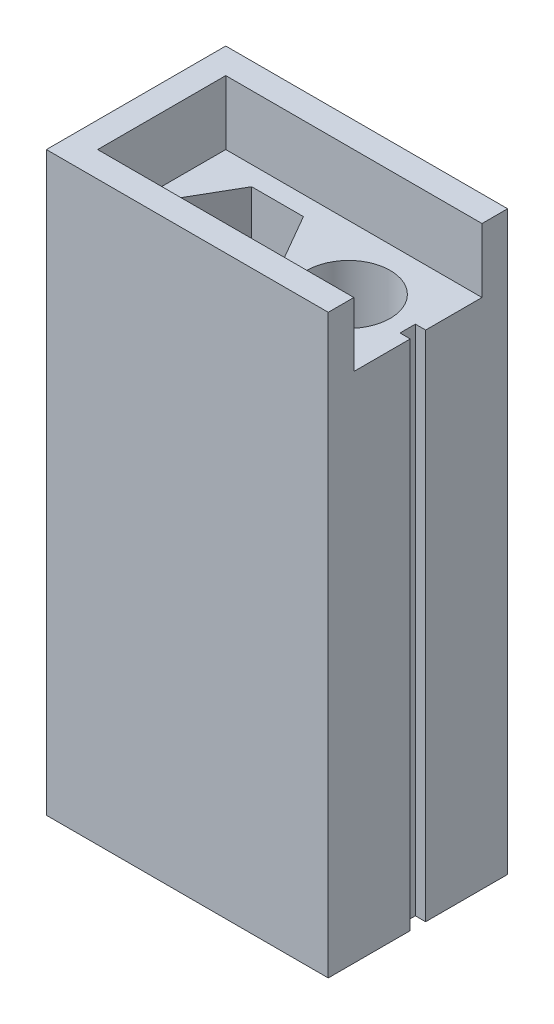
ISO-10303-21;
HEADER;
FILE_DESCRIPTION(('STEP AP214'),'2;1');
FILE_NAME('part.step','',(''),(''),'','','');
FILE_SCHEMA(('AUTOMOTIVE_DESIGN { 1 0 10303 214 1 1 1 1 }'));
ENDSEC;
DATA;
#1=APPLICATION_CONTEXT('core data for automotive mechanical design processes');
#2=APPLICATION_PROTOCOL_DEFINITION('international standard','automotive_design',2000,#1);
#3=PRODUCT_CONTEXT('',#1,'mechanical');
#4=PRODUCT('Part','Part','',(#3));
#5=PRODUCT_RELATED_PRODUCT_CATEGORY('part','',(#4));
#6=PRODUCT_DEFINITION_FORMATION('','',#4);
#7=PRODUCT_DEFINITION_CONTEXT('part definition',#1,'design');
#8=PRODUCT_DEFINITION('design','',#6,#7);
#9=PRODUCT_DEFINITION_SHAPE('','',#8);
#10=(LENGTH_UNIT() NAMED_UNIT(*) SI_UNIT(.MILLI.,.METRE.));
#11=(NAMED_UNIT(*) PLANE_ANGLE_UNIT() SI_UNIT($,.RADIAN.));
#12=(NAMED_UNIT(*) SI_UNIT($,.STERADIAN.) SOLID_ANGLE_UNIT());
#13=UNCERTAINTY_MEASURE_WITH_UNIT(LENGTH_MEASURE(1.E-05),#10,'distance_accuracy_value','');
#14=(GEOMETRIC_REPRESENTATION_CONTEXT(3) GLOBAL_UNCERTAINTY_ASSIGNED_CONTEXT((#13)) GLOBAL_UNIT_ASSIGNED_CONTEXT((#10,
#11,#12)) REPRESENTATION_CONTEXT('',''));
#15=CARTESIAN_POINT('',(0.,0.,0.));
#16=DIRECTION('',(0.,0.,1.));
#17=DIRECTION('',(1.,0.,0.));
#18=AXIS2_PLACEMENT_3D('',#15,#16,#17);
#19=CARTESIAN_POINT('',(22.,40.,0.));
#20=DIRECTION('',(-1.,0.,0.));
#21=DIRECTION('',(0.,0.,1.));
#22=AXIS2_PLACEMENT_3D('',#19,#20,#21);
#23=PLANE('',#22);
#24=DIRECTION('',(0.,0.,-1.));
#25=VECTOR('',#24,1.);
#26=CARTESIAN_POINT('',(22.,0.,0.));
#27=LINE('',#26,#25);
#28=CARTESIAN_POINT('',(22.,0.,0.));
#29=VERTEX_POINT('',#28);
#30=CARTESIAN_POINT('',(22.,0.,-6.40000000000001));
#31=VERTEX_POINT('',#30);
#32=EDGE_CURVE('E324',#29,#31,#27,.T.);
#33=ORIENTED_EDGE('',*,*,#32,.T.);
#34=DIRECTION('',(0.,-1.,0.));
#35=VECTOR('',#34,1.);
#36=CARTESIAN_POINT('',(22.,40.,-6.4));
#37=LINE('',#36,#35);
#38=CARTESIAN_POINT('',(22.,40.,-6.4));
#39=VERTEX_POINT('',#38);
#40=EDGE_CURVE('E321',#39,#31,#37,.T.);
#41=ORIENTED_EDGE('',*,*,#40,.F.);
#42=DIRECTION('',(0.,0.,-1.));
#43=VECTOR('',#42,1.);
#44=CARTESIAN_POINT('',(22.,40.,0.));
#45=LINE('',#44,#43);
#46=CARTESIAN_POINT('',(22.,40.,-2.));
#47=VERTEX_POINT('',#46);
#48=EDGE_CURVE('E300',#47,#39,#45,.T.);
#49=ORIENTED_EDGE('',*,*,#48,.F.);
#50=DIRECTION('',(0.,-1.,0.));
#51=VECTOR('',#50,1.);
#52=CARTESIAN_POINT('',(22.,45.,-2.));
#53=LINE('',#52,#51);
#54=CARTESIAN_POINT('',(22.,45.,-2.));
#55=VERTEX_POINT('',#54);
#56=EDGE_CURVE('E289',#55,#47,#53,.T.);
#57=ORIENTED_EDGE('',*,*,#56,.F.);
#58=DIRECTION('',(0.,0.,-1.));
#59=VECTOR('',#58,1.);
#60=CARTESIAN_POINT('',(22.,45.,0.));
#61=LINE('',#60,#59);
#62=CARTESIAN_POINT('',(22.,45.,0.));
#63=VERTEX_POINT('',#62);
#64=EDGE_CURVE('E245',#63,#55,#61,.T.);
#65=ORIENTED_EDGE('',*,*,#64,.F.);
#66=DIRECTION('',(0.,-1.,0.));
#67=VECTOR('',#66,1.);
#68=CARTESIAN_POINT('',(22.,40.,0.));
#69=LINE('',#68,#67);
#70=EDGE_CURVE('E43',#63,#29,#69,.T.);
#71=ORIENTED_EDGE('',*,*,#70,.T.);
#72=EDGE_LOOP('',(#33,#41,#49,#57,#65,#71));
#73=FACE_BOUND('',#72,.T.);
#74=ADVANCED_FACE('F33',(#73),#23,.F.);
#75=CARTESIAN_POINT('',(0.,40.,0.));
#76=DIRECTION('',(0.,-1.,0.));
#77=DIRECTION('',(0.,0.,-1.));
#78=AXIS2_PLACEMENT_3D('',#75,#76,#77);
#79=PLANE('',#78);
#80=ORIENTED_EDGE('',*,*,#48,.T.);
#81=DIRECTION('',(1.,0.,0.));
#82=VECTOR('',#81,1.);
#83=CARTESIAN_POINT('',(21.2,40.,-6.4));
#84=LINE('',#83,#82);
#85=CARTESIAN_POINT('',(21.2,40.,-6.4));
#86=VERTEX_POINT('',#85);
#87=EDGE_CURVE('E184',#86,#39,#84,.T.);
#88=ORIENTED_EDGE('',*,*,#87,.F.);
#89=DIRECTION('',(0.,0.,1.));
#90=VECTOR('',#89,1.);
#91=CARTESIAN_POINT('',(21.2,40.,-6.4));
#92=LINE('',#91,#90);
#93=CARTESIAN_POINT('',(21.2,40.,-7.6));
#94=VERTEX_POINT('',#93);
#95=EDGE_CURVE('E169',#94,#86,#92,.T.);
#96=ORIENTED_EDGE('',*,*,#95,.F.);
#97=DIRECTION('',(1.,0.,0.));
#98=VECTOR('',#97,1.);
#99=CARTESIAN_POINT('',(21.2,40.,-7.6));
#100=LINE('',#99,#98);
#101=CARTESIAN_POINT('',(22.,40.,-7.6));
#102=VERTEX_POINT('',#101);
#103=EDGE_CURVE('E167',#94,#102,#100,.T.);
#104=ORIENTED_EDGE('',*,*,#103,.T.);
#105=CARTESIAN_POINT('',(22.,40.,-12.));
#106=VERTEX_POINT('',#105);
#107=EDGE_CURVE('E37',#102,#106,#45,.T.);
#108=ORIENTED_EDGE('',*,*,#107,.T.);
#109=DIRECTION('',(1.,0.,0.));
#110=VECTOR('',#109,1.);
#111=CARTESIAN_POINT('',(2.,40.,-12.));
#112=LINE('',#111,#110);
#113=CARTESIAN_POINT('',(2.,40.,-12.));
#114=VERTEX_POINT('',#113);
#115=EDGE_CURVE('E246',#114,#106,#112,.T.);
#116=ORIENTED_EDGE('',*,*,#115,.F.);
#117=DIRECTION('',(0.,0.,-1.));
#118=VECTOR('',#117,1.);
#119=CARTESIAN_POINT('',(2.,40.,-2.));
#120=LINE('',#119,#118);
#121=CARTESIAN_POINT('',(2.,40.,-2.));
#122=VERTEX_POINT('',#121);
#123=EDGE_CURVE('E264',#122,#114,#120,.T.);
#124=ORIENTED_EDGE('',*,*,#123,.F.);
#125=DIRECTION('',(-1.,0.,0.));
#126=VECTOR('',#125,1.);
#127=CARTESIAN_POINT('',(22.,40.,-2.));
#128=LINE('',#127,#126);
#129=EDGE_CURVE('E239',#47,#122,#128,.T.);
#130=ORIENTED_EDGE('',*,*,#129,.F.);
#131=EDGE_LOOP('',(#80,#88,#96,#104,#108,#116,#124,#130));
#132=FACE_BOUND('',#131,.T.);
#133=DIRECTION('',(-0.5,0.,-0.866025403784438));
#134=VECTOR('',#133,1.);
#135=CARTESIAN_POINT('',(11.5829037686548,40.,-7.));
#136=LINE('',#135,#134);
#137=CARTESIAN_POINT('',(11.5829037686548,40.,-7.));
#138=VERTEX_POINT('',#137);
#139=CARTESIAN_POINT('',(9.56217782649108,40.,-10.5));
#140=VERTEX_POINT('',#139);
#141=EDGE_CURVE('E210',#138,#140,#136,.T.);
#142=ORIENTED_EDGE('',*,*,#141,.F.);
#143=DIRECTION('',(0.5,0.,-0.866025403784439));
#144=VECTOR('',#143,1.);
#145=CARTESIAN_POINT('',(9.56217782649108,40.,-3.5));
#146=LINE('',#145,#144);
#147=CARTESIAN_POINT('',(9.56217782649108,40.,-3.5));
#148=VERTEX_POINT('',#147);
#149=EDGE_CURVE('E59',#148,#138,#146,.T.);
#150=ORIENTED_EDGE('',*,*,#149,.F.);
#151=DIRECTION('',(1.,0.,0.));
#152=VECTOR('',#151,1.);
#153=CARTESIAN_POINT('',(5.52072594216369,40.,-3.5));
#154=LINE('',#153,#152);
#155=CARTESIAN_POINT('',(5.52072594216369,40.,-3.5));
#156=VERTEX_POINT('',#155);
#157=EDGE_CURVE('E193',#156,#148,#154,.T.);
#158=ORIENTED_EDGE('',*,*,#157,.F.);
#159=DIRECTION('',(0.5,0.,0.866025403784438));
#160=VECTOR('',#159,1.);
#161=CARTESIAN_POINT('',(3.5,40.,-7.));
#162=LINE('',#161,#160);
#163=CARTESIAN_POINT('',(3.5,40.,-7.));
#164=VERTEX_POINT('',#163);
#165=EDGE_CURVE('E219',#164,#156,#162,.T.);
#166=ORIENTED_EDGE('',*,*,#165,.F.);
#167=DIRECTION('',(-0.5,0.,0.866025403784439));
#168=VECTOR('',#167,1.);
#169=CARTESIAN_POINT('',(5.52072594216369,40.,-10.5));
#170=LINE('',#169,#168);
#171=CARTESIAN_POINT('',(5.52072594216369,40.,-10.5));
#172=VERTEX_POINT('',#171);
#173=EDGE_CURVE('E216',#172,#164,#170,.T.);
#174=ORIENTED_EDGE('',*,*,#173,.F.);
#175=DIRECTION('',(-1.,0.,0.));
#176=VECTOR('',#175,1.);
#177=CARTESIAN_POINT('',(9.56217782649108,40.,-10.5));
#178=LINE('',#177,#176);
#179=EDGE_CURVE('E213',#140,#172,#178,.T.);
#180=ORIENTED_EDGE('',*,*,#179,.F.);
#181=EDGE_LOOP('',(#142,#150,#158,#166,#174,#180));
#182=FACE_BOUND('',#181,.T.);
#183=CARTESIAN_POINT('',(16.5829037686548,40.,-7.));
#184=DIRECTION('',(0.,1.,0.));
#185=DIRECTION('',(0.,0.,1.));
#186=AXIS2_PLACEMENT_3D('',#183,#184,#185);
#187=CIRCLE('',#186,3.25);
#188=CARTESIAN_POINT('',(16.5829037686548,40.,-3.75));
#189=VERTEX_POINT('',#188);
#190=EDGE_CURVE('E226',#189,#189,#187,.T.);
#191=ORIENTED_EDGE('',*,*,#190,.F.);
#192=EDGE_LOOP('',(#191));
#193=FACE_BOUND('',#192,.T.);
#194=ADVANCED_FACE('F314',(#132,#182,#193),#79,.F.);
#195=CARTESIAN_POINT('',(0.,40.,0.));
#196=DIRECTION('',(1.,0.,0.));
#197=DIRECTION('',(0.,0.,-1.));
#198=AXIS2_PLACEMENT_3D('',#195,#196,#197);
#199=PLANE('',#198);
#200=DIRECTION('',(0.,0.,1.));
#201=VECTOR('',#200,1.);
#202=CARTESIAN_POINT('',(0.,0.,0.));
#203=LINE('',#202,#201);
#204=CARTESIAN_POINT('',(0.,0.,-14.));
#205=VERTEX_POINT('',#204);
#206=CARTESIAN_POINT('',(0.,0.,0.));
#207=VERTEX_POINT('',#206);
#208=EDGE_CURVE('E294',#205,#207,#203,.T.);
#209=ORIENTED_EDGE('',*,*,#208,.T.);
#210=DIRECTION('',(0.,-1.,0.));
#211=VECTOR('',#210,1.);
#212=CARTESIAN_POINT('',(0.,40.,0.));
#213=LINE('',#212,#211);
#214=CARTESIAN_POINT('',(0.,45.,0.));
#215=VERTEX_POINT('',#214);
#216=EDGE_CURVE('E11',#215,#207,#213,.T.);
#217=ORIENTED_EDGE('',*,*,#216,.F.);
#218=DIRECTION('',(0.,0.,1.));
#219=VECTOR('',#218,1.);
#220=CARTESIAN_POINT('',(0.,45.,-14.));
#221=LINE('',#220,#219);
#222=CARTESIAN_POINT('',(0.,45.,-14.));
#223=VERTEX_POINT('',#222);
#224=EDGE_CURVE('E260',#223,#215,#221,.T.);
#225=ORIENTED_EDGE('',*,*,#224,.F.);
#226=DIRECTION('',(0.,-1.,0.));
#227=VECTOR('',#226,1.);
#228=CARTESIAN_POINT('',(0.,40.,-14.));
#229=LINE('',#228,#227);
#230=EDGE_CURVE('E303',#223,#205,#229,.T.);
#231=ORIENTED_EDGE('',*,*,#230,.T.);
#232=EDGE_LOOP('',(#209,#217,#225,#231));
#233=FACE_BOUND('',#232,.T.);
#234=ADVANCED_FACE('F35',(#233),#199,.F.);
#235=CARTESIAN_POINT('',(0.,40.,0.));
#236=DIRECTION('',(0.,0.,-1.));
#237=DIRECTION('',(-1.,0.,0.));
#238=AXIS2_PLACEMENT_3D('',#235,#236,#237);
#239=PLANE('',#238);
#240=DIRECTION('',(1.,0.,0.));
#241=VECTOR('',#240,1.);
#242=CARTESIAN_POINT('',(0.,0.,0.));
#243=LINE('',#242,#241);
#244=EDGE_CURVE('E344',#207,#29,#243,.T.);
#245=ORIENTED_EDGE('',*,*,#244,.T.);
#246=ORIENTED_EDGE('',*,*,#70,.F.);
#247=DIRECTION('',(1.,0.,0.));
#248=VECTOR('',#247,1.);
#249=CARTESIAN_POINT('',(0.,45.,0.));
#250=LINE('',#249,#248);
#251=EDGE_CURVE('E242',#215,#63,#250,.T.);
#252=ORIENTED_EDGE('',*,*,#251,.F.);
#253=ORIENTED_EDGE('',*,*,#216,.T.);
#254=EDGE_LOOP('',(#245,#246,#252,#253));
#255=FACE_BOUND('',#254,.T.);
#256=ADVANCED_FACE('F346',(#255),#239,.F.);
#257=ORIENTED_EDGE('',*,*,#107,.F.);
#258=DIRECTION('',(0.,1.,0.));
#259=VECTOR('',#258,1.);
#260=CARTESIAN_POINT('',(22.,40.,-7.6));
#261=LINE('',#260,#259);
#262=CARTESIAN_POINT('',(22.,0.,-7.60000000000001));
#263=VERTEX_POINT('',#262);
#264=EDGE_CURVE('E326',#263,#102,#261,.T.);
#265=ORIENTED_EDGE('',*,*,#264,.F.);
#266=CARTESIAN_POINT('',(22.,0.,-14.));
#267=VERTEX_POINT('',#266);
#268=EDGE_CURVE('E181',#263,#267,#27,.T.);
#269=ORIENTED_EDGE('',*,*,#268,.T.);
#270=DIRECTION('',(0.,-1.,0.));
#271=VECTOR('',#270,1.);
#272=CARTESIAN_POINT('',(22.,40.,-14.));
#273=LINE('',#272,#271);
#274=CARTESIAN_POINT('',(22.,45.,-14.));
#275=VERTEX_POINT('',#274);
#276=EDGE_CURVE('E340',#275,#267,#273,.T.);
#277=ORIENTED_EDGE('',*,*,#276,.F.);
#278=DIRECTION('',(0.,0.,-1.));
#279=VECTOR('',#278,1.);
#280=CARTESIAN_POINT('',(22.,45.,-12.));
#281=LINE('',#280,#279);
#282=CARTESIAN_POINT('',(22.,45.,-12.));
#283=VERTEX_POINT('',#282);
#284=EDGE_CURVE('E254',#283,#275,#281,.T.);
#285=ORIENTED_EDGE('',*,*,#284,.F.);
#286=DIRECTION('',(0.,-1.,0.));
#287=VECTOR('',#286,1.);
#288=CARTESIAN_POINT('',(22.,45.,-12.));
#289=LINE('',#288,#287);
#290=EDGE_CURVE('E263',#283,#106,#289,.T.);
#291=ORIENTED_EDGE('',*,*,#290,.T.);
#292=EDGE_LOOP('',(#257,#265,#269,#277,#285,#291));
#293=FACE_BOUND('',#292,.T.);
#294=ADVANCED_FACE('F331',(#293),#23,.F.);
#295=CARTESIAN_POINT('',(0.,40.,-14.));
#296=DIRECTION('',(0.,0.,1.));
#297=DIRECTION('',(1.,0.,0.));
#298=AXIS2_PLACEMENT_3D('',#295,#296,#297);
#299=PLANE('',#298);
#300=DIRECTION('',(-1.,0.,0.));
#301=VECTOR('',#300,1.);
#302=CARTESIAN_POINT('',(0.,0.,-14.));
#303=LINE('',#302,#301);
#304=EDGE_CURVE('E332',#267,#205,#303,.T.);
#305=ORIENTED_EDGE('',*,*,#304,.T.);
#306=ORIENTED_EDGE('',*,*,#230,.F.);
#307=DIRECTION('',(-1.,0.,0.));
#308=VECTOR('',#307,1.);
#309=CARTESIAN_POINT('',(22.,45.,-14.));
#310=LINE('',#309,#308);
#311=EDGE_CURVE('E257',#275,#223,#310,.T.);
#312=ORIENTED_EDGE('',*,*,#311,.F.);
#313=ORIENTED_EDGE('',*,*,#276,.T.);
#314=EDGE_LOOP('',(#305,#306,#312,#313));
#315=FACE_BOUND('',#314,.T.);
#316=ADVANCED_FACE('F350',(#315),#299,.F.);
#317=CARTESIAN_POINT('',(0.,0.,0.));
#318=DIRECTION('',(0.,-1.,0.));
#319=DIRECTION('',(0.,0.,-1.));
#320=AXIS2_PLACEMENT_3D('',#317,#318,#319);
#321=PLANE('',#320);
#322=DIRECTION('',(1.,0.,0.));
#323=VECTOR('',#322,1.);
#324=CARTESIAN_POINT('',(21.2,0.,-6.40000000000001));
#325=LINE('',#324,#323);
#326=CARTESIAN_POINT('',(21.2,0.,-6.4));
#327=VERTEX_POINT('',#326);
#328=EDGE_CURVE('E182',#327,#31,#325,.T.);
#329=ORIENTED_EDGE('',*,*,#328,.T.);
#330=ORIENTED_EDGE('',*,*,#32,.F.);
#331=ORIENTED_EDGE('',*,*,#244,.F.);
#332=ORIENTED_EDGE('',*,*,#208,.F.);
#333=ORIENTED_EDGE('',*,*,#304,.F.);
#334=ORIENTED_EDGE('',*,*,#268,.F.);
#335=DIRECTION('',(1.,0.,0.));
#336=VECTOR('',#335,1.);
#337=CARTESIAN_POINT('',(21.2,0.,-7.60000000000001));
#338=LINE('',#337,#336);
#339=CARTESIAN_POINT('',(21.2,0.,-7.60000000000001));
#340=VERTEX_POINT('',#339);
#341=EDGE_CURVE('E164',#340,#263,#338,.T.);
#342=ORIENTED_EDGE('',*,*,#341,.F.);
#343=DIRECTION('',(0.,0.,-1.));
#344=VECTOR('',#343,1.);
#345=CARTESIAN_POINT('',(21.2,0.,-6.40000000000001));
#346=LINE('',#345,#344);
#347=EDGE_CURVE('E170',#327,#340,#346,.T.);
#348=ORIENTED_EDGE('',*,*,#347,.F.);
#349=EDGE_LOOP('',(#329,#330,#331,#332,#333,#334,#342,#348));
#350=FACE_BOUND('',#349,.T.);
#351=DIRECTION('',(0.5,0.,-0.866025403784439));
#352=VECTOR('',#351,1.);
#353=CARTESIAN_POINT('',(9.56217782649108,0.,-3.5));
#354=LINE('',#353,#352);
#355=CARTESIAN_POINT('',(9.56217782649108,0.,-3.5));
#356=VERTEX_POINT('',#355);
#357=CARTESIAN_POINT('',(11.5829037686548,0.,-7.));
#358=VERTEX_POINT('',#357);
#359=EDGE_CURVE('E189',#356,#358,#354,.T.);
#360=ORIENTED_EDGE('',*,*,#359,.T.);
#361=DIRECTION('',(-0.5,0.,-0.866025403784438));
#362=VECTOR('',#361,1.);
#363=CARTESIAN_POINT('',(11.5829037686548,0.,-7.));
#364=LINE('',#363,#362);
#365=CARTESIAN_POINT('',(9.56217782649108,0.,-10.5));
#366=VERTEX_POINT('',#365);
#367=EDGE_CURVE('E192',#358,#366,#364,.T.);
#368=ORIENTED_EDGE('',*,*,#367,.T.);
#369=DIRECTION('',(-1.,0.,0.));
#370=VECTOR('',#369,1.);
#371=CARTESIAN_POINT('',(9.56217782649108,0.,-10.5));
#372=LINE('',#371,#370);
#373=CARTESIAN_POINT('',(5.52072594216369,0.,-10.5));
#374=VERTEX_POINT('',#373);
#375=EDGE_CURVE('E196',#366,#374,#372,.T.);
#376=ORIENTED_EDGE('',*,*,#375,.T.);
#377=DIRECTION('',(-0.5,0.,0.866025403784439));
#378=VECTOR('',#377,1.);
#379=CARTESIAN_POINT('',(5.52072594216369,0.,-10.5));
#380=LINE('',#379,#378);
#381=CARTESIAN_POINT('',(3.5,0.,-7.));
#382=VERTEX_POINT('',#381);
#383=EDGE_CURVE('E199',#374,#382,#380,.T.);
#384=ORIENTED_EDGE('',*,*,#383,.T.);
#385=DIRECTION('',(0.5,0.,0.866025403784438));
#386=VECTOR('',#385,1.);
#387=CARTESIAN_POINT('',(3.5,0.,-7.));
#388=LINE('',#387,#386);
#389=CARTESIAN_POINT('',(5.52072594216369,0.,-3.5));
#390=VERTEX_POINT('',#389);
#391=EDGE_CURVE('E202',#382,#390,#388,.T.);
#392=ORIENTED_EDGE('',*,*,#391,.T.);
#393=DIRECTION('',(1.,0.,0.));
#394=VECTOR('',#393,1.);
#395=CARTESIAN_POINT('',(5.52072594216369,0.,-3.5));
#396=LINE('',#395,#394);
#397=EDGE_CURVE('E205',#390,#356,#396,.T.);
#398=ORIENTED_EDGE('',*,*,#397,.T.);
#399=EDGE_LOOP('',(#360,#368,#376,#384,#392,#398));
#400=FACE_BOUND('',#399,.T.);
#401=CARTESIAN_POINT('',(16.5829037686548,0.,-7.));
#402=DIRECTION('',(0.,1.,0.));
#403=DIRECTION('',(0.,0.,1.));
#404=AXIS2_PLACEMENT_3D('',#401,#402,#403);
#405=CIRCLE('',#404,3.25);
#406=CARTESIAN_POINT('',(16.5829037686548,0.,-3.75));
#407=VERTEX_POINT('',#406);
#408=EDGE_CURVE('E236',#407,#407,#405,.T.);
#409=ORIENTED_EDGE('',*,*,#408,.T.);
#410=EDGE_LOOP('',(#409));
#411=FACE_BOUND('',#410,.T.);
#412=ADVANCED_FACE('F178',(#350,#400,#411),#321,.T.);
#413=CARTESIAN_POINT('',(22.,45.,-2.));
#414=DIRECTION('',(0.,0.,1.));
#415=DIRECTION('',(1.,0.,0.));
#416=AXIS2_PLACEMENT_3D('',#413,#414,#415);
#417=PLANE('',#416);
#418=ORIENTED_EDGE('',*,*,#129,.T.);
#419=DIRECTION('',(0.,-1.,0.));
#420=VECTOR('',#419,1.);
#421=CARTESIAN_POINT('',(2.,45.,-2.));
#422=LINE('',#421,#420);
#423=CARTESIAN_POINT('',(2.,45.,-2.));
#424=VERTEX_POINT('',#423);
#425=EDGE_CURVE('E284',#424,#122,#422,.T.);
#426=ORIENTED_EDGE('',*,*,#425,.F.);
#427=DIRECTION('',(-1.,0.,0.));
#428=VECTOR('',#427,1.);
#429=CARTESIAN_POINT('',(22.,45.,-2.));
#430=LINE('',#429,#428);
#431=EDGE_CURVE('E248',#55,#424,#430,.T.);
#432=ORIENTED_EDGE('',*,*,#431,.F.);
#433=ORIENTED_EDGE('',*,*,#56,.T.);
#434=EDGE_LOOP('',(#418,#426,#432,#433));
#435=FACE_BOUND('',#434,.T.);
#436=ADVANCED_FACE('F309',(#435),#417,.F.);
#437=CARTESIAN_POINT('',(2.,45.,-2.));
#438=DIRECTION('',(-1.,0.,0.));
#439=DIRECTION('',(0.,0.,1.));
#440=AXIS2_PLACEMENT_3D('',#437,#438,#439);
#441=PLANE('',#440);
#442=ORIENTED_EDGE('',*,*,#123,.T.);
#443=DIRECTION('',(0.,-1.,0.));
#444=VECTOR('',#443,1.);
#445=CARTESIAN_POINT('',(2.,45.,-12.));
#446=LINE('',#445,#444);
#447=CARTESIAN_POINT('',(2.,45.,-12.));
#448=VERTEX_POINT('',#447);
#449=EDGE_CURVE('E269',#448,#114,#446,.T.);
#450=ORIENTED_EDGE('',*,*,#449,.F.);
#451=DIRECTION('',(0.,0.,-1.));
#452=VECTOR('',#451,1.);
#453=CARTESIAN_POINT('',(2.,45.,-2.));
#454=LINE('',#453,#452);
#455=EDGE_CURVE('E250',#424,#448,#454,.T.);
#456=ORIENTED_EDGE('',*,*,#455,.F.);
#457=ORIENTED_EDGE('',*,*,#425,.T.);
#458=EDGE_LOOP('',(#442,#450,#456,#457));
#459=FACE_BOUND('',#458,.T.);
#460=ADVANCED_FACE('F354',(#459),#441,.F.);
#461=CARTESIAN_POINT('',(2.,45.,-12.));
#462=DIRECTION('',(0.,0.,-1.));
#463=DIRECTION('',(-1.,0.,0.));
#464=AXIS2_PLACEMENT_3D('',#461,#462,#463);
#465=PLANE('',#464);
#466=ORIENTED_EDGE('',*,*,#115,.T.);
#467=ORIENTED_EDGE('',*,*,#290,.F.);
#468=DIRECTION('',(1.,0.,0.));
#469=VECTOR('',#468,1.);
#470=CARTESIAN_POINT('',(2.,45.,-12.));
#471=LINE('',#470,#469);
#472=EDGE_CURVE('E252',#448,#283,#471,.T.);
#473=ORIENTED_EDGE('',*,*,#472,.F.);
#474=ORIENTED_EDGE('',*,*,#449,.T.);
#475=EDGE_LOOP('',(#466,#467,#473,#474));
#476=FACE_BOUND('',#475,.T.);
#477=ADVANCED_FACE('F353',(#476),#465,.F.);
#478=CARTESIAN_POINT('',(0.,45.,0.));
#479=DIRECTION('',(0.,1.,0.));
#480=DIRECTION('',(0.,0.,1.));
#481=AXIS2_PLACEMENT_3D('',#478,#479,#480);
#482=PLANE('',#481);
#483=ORIENTED_EDGE('',*,*,#251,.T.);
#484=ORIENTED_EDGE('',*,*,#64,.T.);
#485=ORIENTED_EDGE('',*,*,#431,.T.);
#486=ORIENTED_EDGE('',*,*,#455,.T.);
#487=ORIENTED_EDGE('',*,*,#472,.T.);
#488=ORIENTED_EDGE('',*,*,#284,.T.);
#489=ORIENTED_EDGE('',*,*,#311,.T.);
#490=ORIENTED_EDGE('',*,*,#224,.T.);
#491=EDGE_LOOP('',(#483,#484,#485,#486,#487,#488,#489,#490));
#492=FACE_BOUND('',#491,.T.);
#493=ADVANCED_FACE('F352',(#492),#482,.T.);
#494=CARTESIAN_POINT('',(16.5829037686548,0.,-7.));
#495=DIRECTION('',(0.,1.,0.));
#496=DIRECTION('',(0.,0.,1.));
#497=AXIS2_PLACEMENT_3D('',#494,#495,#496);
#498=CYLINDRICAL_SURFACE('',#497,3.25);
#499=ORIENTED_EDGE('',*,*,#408,.F.);
#500=EDGE_LOOP('',(#499));
#501=FACE_BOUND('',#500,.T.);
#502=ORIENTED_EDGE('',*,*,#190,.T.);
#503=EDGE_LOOP('',(#502));
#504=FACE_BOUND('',#503,.T.);
#505=ADVANCED_FACE('F454',(#501,#504),#498,.F.);
#506=CARTESIAN_POINT('',(9.56217782649108,0.,-3.5));
#507=DIRECTION('',(0.866025403784439,0.,0.5));
#508=DIRECTION('',(0.5,0.,-0.866025403784439));
#509=AXIS2_PLACEMENT_3D('',#506,#507,#508);
#510=PLANE('',#509);
#511=ORIENTED_EDGE('',*,*,#149,.T.);
#512=DIRECTION('',(0.,1.,0.));
#513=VECTOR('',#512,1.);
#514=CARTESIAN_POINT('',(11.5829037686548,0.,-7.));
#515=LINE('',#514,#513);
#516=EDGE_CURVE('E208',#358,#138,#515,.T.);
#517=ORIENTED_EDGE('',*,*,#516,.F.);
#518=ORIENTED_EDGE('',*,*,#359,.F.);
#519=DIRECTION('',(0.,1.,0.));
#520=VECTOR('',#519,1.);
#521=CARTESIAN_POINT('',(9.56217782649108,0.,-3.5));
#522=LINE('',#521,#520);
#523=EDGE_CURVE('E224',#356,#148,#522,.T.);
#524=ORIENTED_EDGE('',*,*,#523,.T.);
#525=EDGE_LOOP('',(#511,#517,#518,#524));
#526=FACE_BOUND('',#525,.T.);
#527=ADVANCED_FACE('F437',(#526),#510,.F.);
#528=CARTESIAN_POINT('',(5.52072594216369,0.,-3.5));
#529=DIRECTION('',(0.,0.,1.));
#530=DIRECTION('',(1.,0.,0.));
#531=AXIS2_PLACEMENT_3D('',#528,#529,#530);
#532=PLANE('',#531);
#533=ORIENTED_EDGE('',*,*,#157,.T.);
#534=ORIENTED_EDGE('',*,*,#523,.F.);
#535=ORIENTED_EDGE('',*,*,#397,.F.);
#536=DIRECTION('',(0.,1.,0.));
#537=VECTOR('',#536,1.);
#538=CARTESIAN_POINT('',(5.52072594216369,0.,-3.5));
#539=LINE('',#538,#537);
#540=EDGE_CURVE('E227',#390,#156,#539,.T.);
#541=ORIENTED_EDGE('',*,*,#540,.T.);
#542=EDGE_LOOP('',(#533,#534,#535,#541));
#543=FACE_BOUND('',#542,.T.);
#544=ADVANCED_FACE('F433',(#543),#532,.F.);
#545=CARTESIAN_POINT('',(3.5,0.,-7.));
#546=DIRECTION('',(-0.866025403784439,0.,0.5));
#547=DIRECTION('',(0.5,0.,0.866025403784439));
#548=AXIS2_PLACEMENT_3D('',#545,#546,#547);
#549=PLANE('',#548);
#550=ORIENTED_EDGE('',*,*,#165,.T.);
#551=ORIENTED_EDGE('',*,*,#540,.F.);
#552=ORIENTED_EDGE('',*,*,#391,.F.);
#553=DIRECTION('',(0.,1.,0.));
#554=VECTOR('',#553,1.);
#555=CARTESIAN_POINT('',(3.5,0.,-7.));
#556=LINE('',#555,#554);
#557=EDGE_CURVE('E229',#382,#164,#556,.T.);
#558=ORIENTED_EDGE('',*,*,#557,.T.);
#559=EDGE_LOOP('',(#550,#551,#552,#558));
#560=FACE_BOUND('',#559,.T.);
#561=ADVANCED_FACE('F436',(#560),#549,.F.);
#562=CARTESIAN_POINT('',(5.52072594216369,0.,-10.5));
#563=DIRECTION('',(-0.866025403784439,0.,-0.5));
#564=DIRECTION('',(-0.5,0.,0.866025403784439));
#565=AXIS2_PLACEMENT_3D('',#562,#563,#564);
#566=PLANE('',#565);
#567=ORIENTED_EDGE('',*,*,#173,.T.);
#568=ORIENTED_EDGE('',*,*,#557,.F.);
#569=ORIENTED_EDGE('',*,*,#383,.F.);
#570=DIRECTION('',(0.,1.,0.));
#571=VECTOR('',#570,1.);
#572=CARTESIAN_POINT('',(5.52072594216369,0.,-10.5));
#573=LINE('',#572,#571);
#574=EDGE_CURVE('E231',#374,#172,#573,.T.);
#575=ORIENTED_EDGE('',*,*,#574,.T.);
#576=EDGE_LOOP('',(#567,#568,#569,#575));
#577=FACE_BOUND('',#576,.T.);
#578=ADVANCED_FACE('F441',(#577),#566,.F.);
#579=CARTESIAN_POINT('',(9.56217782649108,0.,-10.5));
#580=DIRECTION('',(0.,0.,-1.));
#581=DIRECTION('',(-1.,0.,0.));
#582=AXIS2_PLACEMENT_3D('',#579,#580,#581);
#583=PLANE('',#582);
#584=ORIENTED_EDGE('',*,*,#179,.T.);
#585=ORIENTED_EDGE('',*,*,#574,.F.);
#586=ORIENTED_EDGE('',*,*,#375,.F.);
#587=DIRECTION('',(0.,1.,0.));
#588=VECTOR('',#587,1.);
#589=CARTESIAN_POINT('',(9.56217782649108,0.,-10.5));
#590=LINE('',#589,#588);
#591=EDGE_CURVE('E233',#366,#140,#590,.T.);
#592=ORIENTED_EDGE('',*,*,#591,.T.);
#593=EDGE_LOOP('',(#584,#585,#586,#592));
#594=FACE_BOUND('',#593,.T.);
#595=ADVANCED_FACE('F445',(#594),#583,.F.);
#596=CARTESIAN_POINT('',(11.5829037686548,0.,-7.));
#597=DIRECTION('',(0.866025403784438,0.,-0.5));
#598=DIRECTION('',(-0.5,0.,-0.866025403784438));
#599=AXIS2_PLACEMENT_3D('',#596,#597,#598);
#600=PLANE('',#599);
#601=ORIENTED_EDGE('',*,*,#141,.T.);
#602=ORIENTED_EDGE('',*,*,#591,.F.);
#603=ORIENTED_EDGE('',*,*,#367,.F.);
#604=ORIENTED_EDGE('',*,*,#516,.T.);
#605=EDGE_LOOP('',(#601,#602,#603,#604));
#606=FACE_BOUND('',#605,.T.);
#607=ADVANCED_FACE('F411',(#606),#600,.F.);
#608=CARTESIAN_POINT('',(21.2,40.,-6.4));
#609=DIRECTION('',(0.,0.,1.));
#610=DIRECTION('',(0.,-1.,0.));
#611=AXIS2_PLACEMENT_3D('',#608,#609,#610);
#612=PLANE('',#611);
#613=ORIENTED_EDGE('',*,*,#40,.T.);
#614=ORIENTED_EDGE('',*,*,#328,.F.);
#615=DIRECTION('',(0.,-1.,0.));
#616=VECTOR('',#615,1.);
#617=CARTESIAN_POINT('',(21.2,40.,-6.4));
#618=LINE('',#617,#616);
#619=EDGE_CURVE('E51',#86,#327,#618,.T.);
#620=ORIENTED_EDGE('',*,*,#619,.F.);
#621=ORIENTED_EDGE('',*,*,#87,.T.);
#622=EDGE_LOOP('',(#613,#614,#620,#621));
#623=FACE_BOUND('',#622,.T.);
#624=ADVANCED_FACE('F330',(#623),#612,.F.);
#625=CARTESIAN_POINT('',(21.2,40.,-7.6));
#626=DIRECTION('',(0.,0.,-1.));
#627=DIRECTION('',(0.,1.,0.));
#628=AXIS2_PLACEMENT_3D('',#625,#626,#627);
#629=PLANE('',#628);
#630=ORIENTED_EDGE('',*,*,#264,.T.);
#631=ORIENTED_EDGE('',*,*,#103,.F.);
#632=DIRECTION('',(0.,1.,0.));
#633=VECTOR('',#632,1.);
#634=CARTESIAN_POINT('',(21.2,40.,-7.6));
#635=LINE('',#634,#633);
#636=EDGE_CURVE('E161',#340,#94,#635,.T.);
#637=ORIENTED_EDGE('',*,*,#636,.F.);
#638=ORIENTED_EDGE('',*,*,#341,.T.);
#639=EDGE_LOOP('',(#630,#631,#637,#638));
#640=FACE_BOUND('',#639,.T.);
#641=ADVANCED_FACE('F162',(#640),#629,.F.);
#642=CARTESIAN_POINT('',(21.2,0.,0.));
#643=DIRECTION('',(1.,0.,0.));
#644=DIRECTION('',(0.,0.,-1.));
#645=AXIS2_PLACEMENT_3D('',#642,#643,#644);
#646=PLANE('',#645);
#647=ORIENTED_EDGE('',*,*,#619,.T.);
#648=ORIENTED_EDGE('',*,*,#347,.T.);
#649=ORIENTED_EDGE('',*,*,#636,.T.);
#650=ORIENTED_EDGE('',*,*,#95,.T.);
#651=EDGE_LOOP('',(#647,#648,#649,#650));
#652=FACE_BOUND('',#651,.T.);
#653=ADVANCED_FACE('F173',(#652),#646,.T.);
#654=CLOSED_SHELL('',(#74,#194,#234,#256,#294,#316,#412,#436,#460,#477,#493,#505,#527,#544,#561,
#578,#595,#607,#624,#641,#653));
#655=MANIFOLD_SOLID_BREP('B2',#654);
#656=ADVANCED_BREP_SHAPE_REPRESENTATION('',(#18,#655),#14);
#657=SHAPE_DEFINITION_REPRESENTATION(#9,#656);
ENDSEC;
END-ISO-10303-21;
